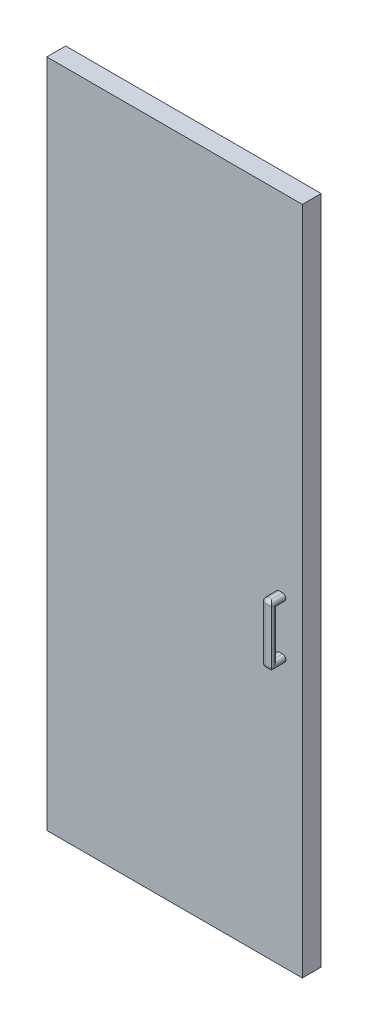
ISO-10303-21;
HEADER;
FILE_DESCRIPTION(('STEP AP214'),'2;1');
FILE_NAME('part.step','',(''),(''),'','','');
FILE_SCHEMA(('AUTOMOTIVE_DESIGN { 1 0 10303 214 1 1 1 1 }'));
ENDSEC;
DATA;
#1=APPLICATION_CONTEXT('core data for automotive mechanical design processes');
#2=APPLICATION_PROTOCOL_DEFINITION('international standard','automotive_design',2000,#1);
#3=PRODUCT_CONTEXT('',#1,'mechanical');
#4=PRODUCT('Part','Part','',(#3));
#5=PRODUCT_RELATED_PRODUCT_CATEGORY('part','',(#4));
#6=PRODUCT_DEFINITION_FORMATION('','',#4);
#7=PRODUCT_DEFINITION_CONTEXT('part definition',#1,'design');
#8=PRODUCT_DEFINITION('design','',#6,#7);
#9=PRODUCT_DEFINITION_SHAPE('','',#8);
#10=(LENGTH_UNIT() NAMED_UNIT(*) SI_UNIT(.MILLI.,.METRE.));
#11=(NAMED_UNIT(*) PLANE_ANGLE_UNIT() SI_UNIT($,.RADIAN.));
#12=(NAMED_UNIT(*) SI_UNIT($,.STERADIAN.) SOLID_ANGLE_UNIT());
#13=UNCERTAINTY_MEASURE_WITH_UNIT(LENGTH_MEASURE(1.E-05),#10,'distance_accuracy_value','');
#14=(GEOMETRIC_REPRESENTATION_CONTEXT(3) GLOBAL_UNCERTAINTY_ASSIGNED_CONTEXT((#13)) GLOBAL_UNIT_ASSIGNED_CONTEXT((#10,
#11,#12)) REPRESENTATION_CONTEXT('',''));
#15=CARTESIAN_POINT('',(0.,0.,0.));
#16=DIRECTION('',(0.,0.,1.));
#17=DIRECTION('',(1.,0.,0.));
#18=AXIS2_PLACEMENT_3D('',#15,#16,#17);
#19=CARTESIAN_POINT('',(0.,0.,0.));
#20=DIRECTION('',(0.,0.,1.));
#21=DIRECTION('',(1.,0.,0.));
#22=AXIS2_PLACEMENT_3D('',#19,#20,#21);
#23=PLANE('',#22);
#24=DIRECTION('',(-1.,0.,0.));
#25=VECTOR('',#24,1.);
#26=CARTESIAN_POINT('',(0.,446.201837212028,0.));
#27=LINE('',#26,#25);
#28=CARTESIAN_POINT('',(0.,446.201837212028,0.));
#29=VERTEX_POINT('',#28);
#30=CARTESIAN_POINT('',(-775.,446.201837212028,0.));
#31=VERTEX_POINT('',#30);
#32=EDGE_CURVE('E255',#29,#31,#27,.T.);
#33=ORIENTED_EDGE('',*,*,#32,.F.);
#34=DIRECTION('',(0.,1.,0.));
#35=VECTOR('',#34,1.);
#36=CARTESIAN_POINT('',(0.,0.,0.));
#37=LINE('',#36,#35);
#38=CARTESIAN_POINT('',(0.,-1585.79816278797,0.));
#39=VERTEX_POINT('',#38);
#40=EDGE_CURVE('E273',#39,#29,#37,.T.);
#41=ORIENTED_EDGE('',*,*,#40,.F.);
#42=DIRECTION('',(1.,0.,0.));
#43=VECTOR('',#42,1.);
#44=CARTESIAN_POINT('',(-775.,-1585.79816278797,0.));
#45=LINE('',#44,#43);
#46=CARTESIAN_POINT('',(-775.,-1585.79816278797,0.));
#47=VERTEX_POINT('',#46);
#48=EDGE_CURVE('E284',#47,#39,#45,.T.);
#49=ORIENTED_EDGE('',*,*,#48,.F.);
#50=DIRECTION('',(0.,-1.,0.));
#51=VECTOR('',#50,1.);
#52=CARTESIAN_POINT('',(-775.,446.201837212028,0.));
#53=LINE('',#52,#51);
#54=EDGE_CURVE('E282',#31,#47,#53,.T.);
#55=ORIENTED_EDGE('',*,*,#54,.F.);
#56=EDGE_LOOP('',(#33,#41,#49,#55));
#57=FACE_BOUND('',#56,.T.);
#58=DIRECTION('',(0.,1.,0.));
#59=VECTOR('',#58,1.);
#60=CARTESIAN_POINT('',(-145.,-924.798162787972,0.));
#61=LINE('',#60,#59);
#62=CARTESIAN_POINT('',(-145.,-924.798162787972,0.));
#63=VERTEX_POINT('',#62);
#64=CARTESIAN_POINT('',(-145.,-464.798162787972,0.));
#65=VERTEX_POINT('',#64);
#66=EDGE_CURVE('E231',#63,#65,#61,.T.);
#67=ORIENTED_EDGE('',*,*,#66,.F.);
#68=DIRECTION('',(-1.,0.,0.));
#69=VECTOR('',#68,1.);
#70=CARTESIAN_POINT('',(-25.,-924.798162787972,0.));
#71=LINE('',#70,#69);
#72=CARTESIAN_POINT('',(-25.,-924.798162787972,0.));
#73=VERTEX_POINT('',#72);
#74=EDGE_CURVE('E228',#73,#63,#71,.T.);
#75=ORIENTED_EDGE('',*,*,#74,.F.);
#76=DIRECTION('',(0.,-1.,0.));
#77=VECTOR('',#76,1.);
#78=CARTESIAN_POINT('',(-25.,-924.798162787972,0.));
#79=LINE('',#78,#77);
#80=CARTESIAN_POINT('',(-25.,-464.798162787972,0.));
#81=VERTEX_POINT('',#80);
#82=EDGE_CURVE('E59',#81,#73,#79,.T.);
#83=ORIENTED_EDGE('',*,*,#82,.F.);
#84=DIRECTION('',(1.,0.,0.));
#85=VECTOR('',#84,1.);
#86=CARTESIAN_POINT('',(-25.,-464.798162787972,0.));
#87=LINE('',#86,#85);
#88=EDGE_CURVE('E54',#65,#81,#87,.T.);
#89=ORIENTED_EDGE('',*,*,#88,.F.);
#90=EDGE_LOOP('',(#67,#75,#83,#89));
#91=FACE_BOUND('',#90,.T.);
#92=ADVANCED_FACE('F37',(#57,#91),#23,.F.);
#93=CARTESIAN_POINT('',(-79.9999999999999,-603.798162787972,101.15));
#94=DIRECTION('',(1.,0.,0.));
#95=DIRECTION('',(0.,1.,0.));
#96=AXIS2_PLACEMENT_3D('',#93,#94,#95);
#97=PLANE('',#96);
#98=DIRECTION('',(0.,-1.,0.));
#99=VECTOR('',#98,1.);
#100=CARTESIAN_POINT('',(-79.9999999999999,-603.798162787972,57.15));
#101=LINE('',#100,#99);
#102=CARTESIAN_POINT('',(-79.9999999999999,-774.798162787972,57.15));
#103=VERTEX_POINT('',#102);
#104=CARTESIAN_POINT('',(-79.9999999999999,-775.798162787972,57.15));
#105=VERTEX_POINT('',#104);
#106=EDGE_CURVE('E263',#103,#105,#101,.T.);
#107=ORIENTED_EDGE('',*,*,#106,.T.);
#108=DIRECTION('',(0.,0.,-1.));
#109=VECTOR('',#108,1.);
#110=CARTESIAN_POINT('',(-79.9999999999999,-775.798162787972,101.15));
#111=LINE('',#110,#109);
#112=CARTESIAN_POINT('',(-79.9999999999999,-775.798162787972,91.15));
#113=VERTEX_POINT('',#112);
#114=EDGE_CURVE('E326',#105,#113,#111,.F.);
#115=ORIENTED_EDGE('',*,*,#114,.T.);
#116=DIRECTION('',(0.,-1.,0.));
#117=VECTOR('',#116,1.);
#118=CARTESIAN_POINT('',(-79.9999999999999,-603.798162787972,91.15));
#119=LINE('',#118,#117);
#120=CARTESIAN_POINT('',(-79.9999999999999,-774.798162787972,91.15));
#121=VERTEX_POINT('',#120);
#122=EDGE_CURVE('E322',#113,#121,#119,.F.);
#123=ORIENTED_EDGE('',*,*,#122,.T.);
#124=DIRECTION('',(0.,0.,-1.));
#125=VECTOR('',#124,1.);
#126=CARTESIAN_POINT('',(-79.9999999999999,-774.798162787972,57.15));
#127=LINE('',#126,#125);
#128=EDGE_CURVE('E324',#121,#103,#127,.T.);
#129=ORIENTED_EDGE('',*,*,#128,.T.);
#130=EDGE_LOOP('',(#107,#115,#123,#129));
#131=FACE_BOUND('',#130,.T.);
#132=ADVANCED_FACE('F495',(#131),#97,.F.);
#133=CARTESIAN_POINT('',(-49.9999999999999,-603.798162787972,101.15));
#134=DIRECTION('',(-1.,0.,0.));
#135=DIRECTION('',(0.,-1.,0.));
#136=AXIS2_PLACEMENT_3D('',#133,#134,#135);
#137=PLANE('',#136);
#138=DIRECTION('',(0.,1.,0.));
#139=VECTOR('',#138,1.);
#140=CARTESIAN_POINT('',(-49.9999999999999,-603.798162787972,57.15));
#141=LINE('',#140,#139);
#142=CARTESIAN_POINT('',(-49.9999999999999,-614.798162787972,57.15));
#143=VERTEX_POINT('',#142);
#144=CARTESIAN_POINT('',(-49.9999999999999,-613.798162787972,57.15));
#145=VERTEX_POINT('',#144);
#146=EDGE_CURVE('E241',#143,#145,#141,.T.);
#147=ORIENTED_EDGE('',*,*,#146,.T.);
#148=DIRECTION('',(0.,0.,-1.));
#149=VECTOR('',#148,1.);
#150=CARTESIAN_POINT('',(-49.9999999999999,-613.798162787972,101.15));
#151=LINE('',#150,#149);
#152=CARTESIAN_POINT('',(-49.9999999999999,-613.798162787972,101.15));
#153=VERTEX_POINT('',#152);
#154=EDGE_CURVE('E341',#145,#153,#151,.F.);
#155=ORIENTED_EDGE('',*,*,#154,.T.);
#156=DIRECTION('',(0.,1.,0.));
#157=VECTOR('',#156,1.);
#158=CARTESIAN_POINT('',(-49.9999999999999,-603.798162787972,101.15));
#159=LINE('',#158,#157);
#160=CARTESIAN_POINT('',(-49.9999999999999,-775.798162787972,101.15));
#161=VERTEX_POINT('',#160);
#162=EDGE_CURVE('E252',#161,#153,#159,.T.);
#163=ORIENTED_EDGE('',*,*,#162,.F.);
#164=DIRECTION('',(0.,0.,-1.));
#165=VECTOR('',#164,1.);
#166=CARTESIAN_POINT('',(-49.9999999999999,-775.798162787972,101.15));
#167=LINE('',#166,#165);
#168=CARTESIAN_POINT('',(-49.9999999999999,-775.798162787972,57.15));
#169=VERTEX_POINT('',#168);
#170=EDGE_CURVE('E333',#161,#169,#167,.T.);
#171=ORIENTED_EDGE('',*,*,#170,.T.);
#172=CARTESIAN_POINT('',(-49.9999999999999,-774.798162787972,57.15));
#173=VERTEX_POINT('',#172);
#174=EDGE_CURVE('E257',#169,#173,#141,.T.);
#175=ORIENTED_EDGE('',*,*,#174,.T.);
#176=DIRECTION('',(0.,0.,-1.));
#177=VECTOR('',#176,1.);
#178=CARTESIAN_POINT('',(-49.9999999999999,-774.798162787972,83.15));
#179=LINE('',#178,#177);
#180=CARTESIAN_POINT('',(-49.9999999999999,-774.798162787972,93.15));
#181=VERTEX_POINT('',#180);
#182=EDGE_CURVE('E335',#173,#181,#179,.F.);
#183=ORIENTED_EDGE('',*,*,#182,.T.);
#184=DIRECTION('',(0.,-1.,0.));
#185=VECTOR('',#184,1.);
#186=CARTESIAN_POINT('',(-49.9999999999999,-624.798162787972,93.15));
#187=LINE('',#186,#185);
#188=CARTESIAN_POINT('',(-49.9999999999999,-614.798162787972,93.15));
#189=VERTEX_POINT('',#188);
#190=EDGE_CURVE('E337',#181,#189,#187,.F.);
#191=ORIENTED_EDGE('',*,*,#190,.T.);
#192=DIRECTION('',(0.,0.,1.));
#193=VECTOR('',#192,1.);
#194=CARTESIAN_POINT('',(-49.9999999999999,-614.798162787972,57.15));
#195=LINE('',#194,#193);
#196=EDGE_CURVE('E339',#189,#143,#195,.F.);
#197=ORIENTED_EDGE('',*,*,#196,.T.);
#198=EDGE_LOOP('',(#147,#155,#163,#171,#175,#183,#191,#197));
#199=FACE_BOUND('',#198,.T.);
#200=ADVANCED_FACE('F415',(#199),#137,.F.);
#201=DIRECTION('',(0.,-1.,0.));
#202=VECTOR('',#201,1.);
#203=CARTESIAN_POINT('',(-79.9999999999999,-603.798162787972,91.15));
#204=LINE('',#203,#202);
#205=CARTESIAN_POINT('',(-79.9999999999999,-614.798162787972,91.15));
#206=VERTEX_POINT('',#205);
#207=CARTESIAN_POINT('',(-79.9999999999999,-613.798162787972,91.15));
#208=VERTEX_POINT('',#207);
#209=EDGE_CURVE('E316',#206,#208,#204,.F.);
#210=ORIENTED_EDGE('',*,*,#209,.T.);
#211=DIRECTION('',(0.,0.,-1.));
#212=VECTOR('',#211,1.);
#213=CARTESIAN_POINT('',(-79.9999999999999,-613.798162787972,101.15));
#214=LINE('',#213,#212);
#215=CARTESIAN_POINT('',(-79.9999999999999,-613.798162787972,57.15));
#216=VERTEX_POINT('',#215);
#217=EDGE_CURVE('E320',#208,#216,#214,.T.);
#218=ORIENTED_EDGE('',*,*,#217,.T.);
#219=CARTESIAN_POINT('',(-79.9999999999999,-614.798162787972,57.15));
#220=VERTEX_POINT('',#219);
#221=EDGE_CURVE('E264',#216,#220,#101,.T.);
#222=ORIENTED_EDGE('',*,*,#221,.T.);
#223=DIRECTION('',(0.,0.,1.));
#224=VECTOR('',#223,1.);
#225=CARTESIAN_POINT('',(-79.9999999999999,-614.798162787972,83.15));
#226=LINE('',#225,#224);
#227=EDGE_CURVE('E318',#220,#206,#226,.T.);
#228=ORIENTED_EDGE('',*,*,#227,.T.);
#229=EDGE_LOOP('',(#210,#218,#222,#228));
#230=FACE_BOUND('',#229,.T.);
#231=ADVANCED_FACE('F501',(#230),#97,.F.);
#232=CARTESIAN_POINT('',(0.,0.,57.15));
#233=DIRECTION('',(0.,0.,1.));
#234=DIRECTION('',(1.,0.,0.));
#235=AXIS2_PLACEMENT_3D('',#232,#233,#234);
#236=PLANE('',#235);
#237=DIRECTION('',(-1.,0.,0.));
#238=VECTOR('',#237,1.);
#239=CARTESIAN_POINT('',(-35.9999999999999,-764.798162787972,57.15));
#240=LINE('',#239,#238);
#241=CARTESIAN_POINT('',(-59.9999999999999,-764.798162787972,57.15));
#242=VERTEX_POINT('',#241);
#243=CARTESIAN_POINT('',(-69.9999999999999,-764.798162787972,57.15));
#244=VERTEX_POINT('',#243);
#245=EDGE_CURVE('E238',#242,#244,#240,.T.);
#246=ORIENTED_EDGE('',*,*,#245,.F.);
#247=CARTESIAN_POINT('',(-59.9999999999999,-774.798162787972,57.15));
#248=DIRECTION('',(0.,0.,1.));
#249=DIRECTION('',(1.,0.,0.));
#250=AXIS2_PLACEMENT_3D('',#247,#248,#249);
#251=CIRCLE('',#250,10.);
#252=EDGE_CURVE('E361',#242,#173,#251,.F.);
#253=ORIENTED_EDGE('',*,*,#252,.T.);
#254=ORIENTED_EDGE('',*,*,#174,.F.);
#255=CARTESIAN_POINT('',(-59.9999999999999,-775.798162787972,57.15));
#256=DIRECTION('',(0.,0.,1.));
#257=DIRECTION('',(1.,0.,0.));
#258=AXIS2_PLACEMENT_3D('',#255,#256,#257);
#259=CIRCLE('',#258,10.);
#260=CARTESIAN_POINT('',(-59.9999999999999,-785.798162787972,57.15));
#261=VERTEX_POINT('',#260);
#262=EDGE_CURVE('E363',#169,#261,#259,.F.);
#263=ORIENTED_EDGE('',*,*,#262,.T.);
#264=DIRECTION('',(1.,0.,0.));
#265=VECTOR('',#264,1.);
#266=CARTESIAN_POINT('',(-79.9999999999999,-785.798162787972,57.15));
#267=LINE('',#266,#265);
#268=CARTESIAN_POINT('',(-69.9999999999999,-785.798162787972,57.15));
#269=VERTEX_POINT('',#268);
#270=EDGE_CURVE('E256',#269,#261,#267,.T.);
#271=ORIENTED_EDGE('',*,*,#270,.F.);
#272=CARTESIAN_POINT('',(-69.9999999999999,-775.798162787972,57.15));
#273=DIRECTION('',(0.,0.,1.));
#274=DIRECTION('',(1.,0.,0.));
#275=AXIS2_PLACEMENT_3D('',#272,#273,#274);
#276=CIRCLE('',#275,10.);
#277=EDGE_CURVE('E46',#269,#105,#276,.F.);
#278=ORIENTED_EDGE('',*,*,#277,.T.);
#279=ORIENTED_EDGE('',*,*,#106,.F.);
#280=CARTESIAN_POINT('',(-69.9999999999999,-774.798162787972,57.15));
#281=DIRECTION('',(0.,0.,1.));
#282=DIRECTION('',(1.,0.,0.));
#283=AXIS2_PLACEMENT_3D('',#280,#281,#282);
#284=CIRCLE('',#283,10.);
#285=EDGE_CURVE('E11',#103,#244,#284,.F.);
#286=ORIENTED_EDGE('',*,*,#285,.T.);
#287=EDGE_LOOP('',(#246,#253,#254,#263,#271,#278,#279,#286));
#288=FACE_BOUND('',#287,.T.);
#289=ORIENTED_EDGE('',*,*,#146,.F.);
#290=CARTESIAN_POINT('',(-59.9999999999999,-614.798162787972,57.15));
#291=DIRECTION('',(0.,0.,1.));
#292=DIRECTION('',(1.,0.,0.));
#293=AXIS2_PLACEMENT_3D('',#290,#291,#292);
#294=CIRCLE('',#293,10.);
#295=CARTESIAN_POINT('',(-59.9999999999999,-624.798162787972,57.15));
#296=VERTEX_POINT('',#295);
#297=EDGE_CURVE('E359',#143,#296,#294,.F.);
#298=ORIENTED_EDGE('',*,*,#297,.T.);
#299=DIRECTION('',(-1.,0.,0.));
#300=VECTOR('',#299,1.);
#301=CARTESIAN_POINT('',(-35.9999999999999,-624.798162787972,57.15));
#302=LINE('',#301,#300);
#303=CARTESIAN_POINT('',(-69.9999999999999,-624.798162787972,57.15));
#304=VERTEX_POINT('',#303);
#305=EDGE_CURVE('E242',#296,#304,#302,.T.);
#306=ORIENTED_EDGE('',*,*,#305,.T.);
#307=CARTESIAN_POINT('',(-69.9999999999999,-614.798162787972,57.15));
#308=DIRECTION('',(0.,0.,1.));
#309=DIRECTION('',(1.,0.,0.));
#310=AXIS2_PLACEMENT_3D('',#307,#308,#309);
#311=CIRCLE('',#310,10.);
#312=EDGE_CURVE('E355',#304,#220,#311,.F.);
#313=ORIENTED_EDGE('',*,*,#312,.T.);
#314=ORIENTED_EDGE('',*,*,#221,.F.);
#315=CARTESIAN_POINT('',(-69.9999999999999,-613.798162787972,57.15));
#316=DIRECTION('',(0.,0.,1.));
#317=DIRECTION('',(1.,0.,0.));
#318=AXIS2_PLACEMENT_3D('',#315,#316,#317);
#319=CIRCLE('',#318,10.);
#320=CARTESIAN_POINT('',(-69.9999999999999,-603.798162787972,57.15));
#321=VERTEX_POINT('',#320);
#322=EDGE_CURVE('E353',#216,#321,#319,.F.);
#323=ORIENTED_EDGE('',*,*,#322,.T.);
#324=DIRECTION('',(-1.,0.,0.));
#325=VECTOR('',#324,1.);
#326=CARTESIAN_POINT('',(-79.9999999999999,-603.798162787972,57.15));
#327=LINE('',#326,#325);
#328=CARTESIAN_POINT('',(-59.9999999999999,-603.798162787972,57.15));
#329=VERTEX_POINT('',#328);
#330=EDGE_CURVE('E260',#329,#321,#327,.T.);
#331=ORIENTED_EDGE('',*,*,#330,.F.);
#332=CARTESIAN_POINT('',(-59.9999999999999,-613.798162787972,57.15));
#333=DIRECTION('',(0.,0.,1.));
#334=DIRECTION('',(1.,0.,0.));
#335=AXIS2_PLACEMENT_3D('',#332,#333,#334);
#336=CIRCLE('',#335,10.);
#337=EDGE_CURVE('E357',#329,#145,#336,.F.);
#338=ORIENTED_EDGE('',*,*,#337,.T.);
#339=EDGE_LOOP('',(#289,#298,#306,#313,#314,#323,#331,#338));
#340=FACE_BOUND('',#339,.T.);
#341=DIRECTION('',(-1.,0.,0.));
#342=VECTOR('',#341,1.);
#343=CARTESIAN_POINT('',(0.,446.201837212028,57.15));
#344=LINE('',#343,#342);
#345=CARTESIAN_POINT('',(0.,446.201837212028,57.15));
#346=VERTEX_POINT('',#345);
#347=CARTESIAN_POINT('',(-775.,446.201837212028,57.15));
#348=VERTEX_POINT('',#347);
#349=EDGE_CURVE('E269',#346,#348,#344,.T.);
#350=ORIENTED_EDGE('',*,*,#349,.T.);
#351=DIRECTION('',(0.,-1.,0.));
#352=VECTOR('',#351,1.);
#353=CARTESIAN_POINT('',(-775.,446.201837212028,57.15));
#354=LINE('',#353,#352);
#355=CARTESIAN_POINT('',(-775.,-1585.79816278797,57.15));
#356=VERTEX_POINT('',#355);
#357=EDGE_CURVE('E272',#348,#356,#354,.T.);
#358=ORIENTED_EDGE('',*,*,#357,.T.);
#359=DIRECTION('',(1.,0.,0.));
#360=VECTOR('',#359,1.);
#361=CARTESIAN_POINT('',(-775.,-1585.79816278797,57.15));
#362=LINE('',#361,#360);
#363=CARTESIAN_POINT('',(0.,-1585.79816278797,57.15));
#364=VERTEX_POINT('',#363);
#365=EDGE_CURVE('E275',#356,#364,#362,.T.);
#366=ORIENTED_EDGE('',*,*,#365,.T.);
#367=DIRECTION('',(0.,1.,0.));
#368=VECTOR('',#367,1.);
#369=CARTESIAN_POINT('',(0.,-1585.79816278797,57.15));
#370=LINE('',#369,#368);
#371=EDGE_CURVE('E277',#364,#346,#370,.T.);
#372=ORIENTED_EDGE('',*,*,#371,.T.);
#373=EDGE_LOOP('',(#350,#358,#366,#372));
#374=FACE_BOUND('',#373,.T.);
#375=ADVANCED_FACE('F419',(#288,#340,#374),#236,.T.);
#376=CARTESIAN_POINT('',(0.,446.201837212028,57.15));
#377=DIRECTION('',(0.,-1.,0.));
#378=DIRECTION('',(1.,0.,0.));
#379=AXIS2_PLACEMENT_3D('',#376,#377,#378);
#380=PLANE('',#379);
#381=ORIENTED_EDGE('',*,*,#32,.T.);
#382=DIRECTION('',(0.,0.,-1.));
#383=VECTOR('',#382,1.);
#384=CARTESIAN_POINT('',(-775.,446.201837212028,57.15));
#385=LINE('',#384,#383);
#386=EDGE_CURVE('E296',#348,#31,#385,.T.);
#387=ORIENTED_EDGE('',*,*,#386,.F.);
#388=ORIENTED_EDGE('',*,*,#349,.F.);
#389=DIRECTION('',(0.,0.,-1.));
#390=VECTOR('',#389,1.);
#391=CARTESIAN_POINT('',(0.,446.201837212028,57.15));
#392=LINE('',#391,#390);
#393=EDGE_CURVE('E279',#346,#29,#392,.T.);
#394=ORIENTED_EDGE('',*,*,#393,.T.);
#395=EDGE_LOOP('',(#381,#387,#388,#394));
#396=FACE_BOUND('',#395,.T.);
#397=ADVANCED_FACE('F542',(#396),#380,.F.);
#398=CARTESIAN_POINT('',(-775.,446.201837212028,57.15));
#399=DIRECTION('',(1.,0.,0.));
#400=DIRECTION('',(0.,1.,0.));
#401=AXIS2_PLACEMENT_3D('',#398,#399,#400);
#402=PLANE('',#401);
#403=ORIENTED_EDGE('',*,*,#54,.T.);
#404=DIRECTION('',(0.,0.,-1.));
#405=VECTOR('',#404,1.);
#406=CARTESIAN_POINT('',(-775.,-1585.79816278797,57.15));
#407=LINE('',#406,#405);
#408=EDGE_CURVE('E293',#356,#47,#407,.T.);
#409=ORIENTED_EDGE('',*,*,#408,.F.);
#410=ORIENTED_EDGE('',*,*,#357,.F.);
#411=ORIENTED_EDGE('',*,*,#386,.T.);
#412=EDGE_LOOP('',(#403,#409,#410,#411));
#413=FACE_BOUND('',#412,.T.);
#414=ADVANCED_FACE('F538',(#413),#402,.F.);
#415=CARTESIAN_POINT('',(-775.,-1585.79816278797,57.15));
#416=DIRECTION('',(0.,1.,0.));
#417=DIRECTION('',(0.,0.,1.));
#418=AXIS2_PLACEMENT_3D('',#415,#416,#417);
#419=PLANE('',#418);
#420=ORIENTED_EDGE('',*,*,#48,.T.);
#421=DIRECTION('',(0.,0.,-1.));
#422=VECTOR('',#421,1.);
#423=CARTESIAN_POINT('',(0.,-1585.79816278797,57.15));
#424=LINE('',#423,#422);
#425=EDGE_CURVE('E290',#364,#39,#424,.T.);
#426=ORIENTED_EDGE('',*,*,#425,.F.);
#427=ORIENTED_EDGE('',*,*,#365,.F.);
#428=ORIENTED_EDGE('',*,*,#408,.T.);
#429=EDGE_LOOP('',(#420,#426,#427,#428));
#430=FACE_BOUND('',#429,.T.);
#431=ADVANCED_FACE('F534',(#430),#419,.F.);
#432=CARTESIAN_POINT('',(0.,0.,57.15));
#433=DIRECTION('',(-1.,0.,0.));
#434=DIRECTION('',(0.,0.,1.));
#435=AXIS2_PLACEMENT_3D('',#432,#433,#434);
#436=PLANE('',#435);
#437=ORIENTED_EDGE('',*,*,#40,.T.);
#438=ORIENTED_EDGE('',*,*,#393,.F.);
#439=ORIENTED_EDGE('',*,*,#371,.F.);
#440=ORIENTED_EDGE('',*,*,#425,.T.);
#441=EDGE_LOOP('',(#437,#438,#439,#440));
#442=FACE_BOUND('',#441,.T.);
#443=ADVANCED_FACE('F531',(#442),#436,.F.);
#444=CARTESIAN_POINT('',(-79.9999999999999,-603.798162787972,101.15));
#445=DIRECTION('',(0.,-1.,0.));
#446=DIRECTION('',(0.,0.,-1.));
#447=AXIS2_PLACEMENT_3D('',#444,#445,#446);
#448=PLANE('',#447);
#449=ORIENTED_EDGE('',*,*,#330,.T.);
#450=DIRECTION('',(0.,0.,-1.));
#451=VECTOR('',#450,1.);
#452=CARTESIAN_POINT('',(-69.9999999999999,-603.798162787972,101.15));
#453=LINE('',#452,#451);
#454=CARTESIAN_POINT('',(-69.9999999999999,-603.798162787972,91.15));
#455=VERTEX_POINT('',#454);
#456=EDGE_CURVE('E310',#321,#455,#453,.F.);
#457=ORIENTED_EDGE('',*,*,#456,.T.);
#458=DIRECTION('',(-1.,0.,0.));
#459=VECTOR('',#458,1.);
#460=CARTESIAN_POINT('',(-49.9999999999999,-603.798162787972,91.15));
#461=LINE('',#460,#459);
#462=CARTESIAN_POINT('',(-59.9999999999999,-603.798162787972,91.15));
#463=VERTEX_POINT('',#462);
#464=EDGE_CURVE('E308',#455,#463,#461,.F.);
#465=ORIENTED_EDGE('',*,*,#464,.T.);
#466=DIRECTION('',(0.,0.,-1.));
#467=VECTOR('',#466,1.);
#468=CARTESIAN_POINT('',(-59.9999999999999,-603.798162787972,101.15));
#469=LINE('',#468,#467);
#470=EDGE_CURVE('E306',#463,#329,#469,.T.);
#471=ORIENTED_EDGE('',*,*,#470,.T.);
#472=EDGE_LOOP('',(#449,#457,#465,#471));
#473=FACE_BOUND('',#472,.T.);
#474=ADVANCED_FACE('F509',(#473),#448,.F.);
#475=CARTESIAN_POINT('',(-79.9999999999999,-785.798162787972,101.15));
#476=DIRECTION('',(0.,1.,0.));
#477=DIRECTION('',(0.,0.,1.));
#478=AXIS2_PLACEMENT_3D('',#475,#476,#477);
#479=PLANE('',#478);
#480=ORIENTED_EDGE('',*,*,#270,.T.);
#481=DIRECTION('',(0.,0.,-1.));
#482=VECTOR('',#481,1.);
#483=CARTESIAN_POINT('',(-59.9999999999999,-785.798162787972,101.15));
#484=LINE('',#483,#482);
#485=CARTESIAN_POINT('',(-59.9999999999999,-785.798162787972,91.15));
#486=VERTEX_POINT('',#485);
#487=EDGE_CURVE('E351',#261,#486,#484,.F.);
#488=ORIENTED_EDGE('',*,*,#487,.T.);
#489=DIRECTION('',(1.,0.,0.));
#490=VECTOR('',#489,1.);
#491=CARTESIAN_POINT('',(-79.9999999999999,-785.798162787972,91.15));
#492=LINE('',#491,#490);
#493=CARTESIAN_POINT('',(-69.9999999999999,-785.798162787972,91.15));
#494=VERTEX_POINT('',#493);
#495=EDGE_CURVE('E347',#486,#494,#492,.F.);
#496=ORIENTED_EDGE('',*,*,#495,.T.);
#497=DIRECTION('',(0.,0.,-1.));
#498=VECTOR('',#497,1.);
#499=CARTESIAN_POINT('',(-69.9999999999999,-785.798162787972,101.15));
#500=LINE('',#499,#498);
#501=EDGE_CURVE('E349',#494,#269,#500,.T.);
#502=ORIENTED_EDGE('',*,*,#501,.T.);
#503=EDGE_LOOP('',(#480,#488,#496,#502));
#504=FACE_BOUND('',#503,.T.);
#505=ADVANCED_FACE('F490',(#504),#479,.F.);
#506=CARTESIAN_POINT('',(0.,0.,101.15));
#507=DIRECTION('',(0.,0.,1.));
#508=DIRECTION('',(1.,0.,0.));
#509=AXIS2_PLACEMENT_3D('',#506,#507,#508);
#510=PLANE('',#509);
#511=ORIENTED_EDGE('',*,*,#162,.T.);
#512=DIRECTION('',(-1.,0.,0.));
#513=VECTOR('',#512,1.);
#514=CARTESIAN_POINT('',(-79.9999999999999,-613.798162787972,101.15));
#515=LINE('',#514,#513);
#516=CARTESIAN_POINT('',(-69.9999999999999,-613.798162787972,101.15));
#517=VERTEX_POINT('',#516);
#518=EDGE_CURVE('E303',#153,#517,#515,.T.);
#519=ORIENTED_EDGE('',*,*,#518,.T.);
#520=DIRECTION('',(0.,-1.,0.));
#521=VECTOR('',#520,1.);
#522=CARTESIAN_POINT('',(-69.9999999999999,-785.798162787972,101.15));
#523=LINE('',#522,#521);
#524=CARTESIAN_POINT('',(-69.9999999999999,-775.798162787972,101.15));
#525=VERTEX_POINT('',#524);
#526=EDGE_CURVE('E301',#517,#525,#523,.T.);
#527=ORIENTED_EDGE('',*,*,#526,.T.);
#528=DIRECTION('',(1.,0.,0.));
#529=VECTOR('',#528,1.);
#530=CARTESIAN_POINT('',(-49.9999999999999,-775.798162787972,101.15));
#531=LINE('',#530,#529);
#532=EDGE_CURVE('E299',#525,#161,#531,.T.);
#533=ORIENTED_EDGE('',*,*,#532,.T.);
#534=EDGE_LOOP('',(#511,#519,#527,#533));
#535=FACE_BOUND('',#534,.T.);
#536=ADVANCED_FACE('F473',(#535),#510,.T.);
#537=CARTESIAN_POINT('',(-35.9999999999999,-764.798162787972,0.));
#538=DIRECTION('',(0.,1.,0.));
#539=DIRECTION('',(-1.,0.,0.));
#540=AXIS2_PLACEMENT_3D('',#537,#538,#539);
#541=PLANE('',#540);
#542=DIRECTION('',(-1.,0.,0.));
#543=VECTOR('',#542,1.);
#544=CARTESIAN_POINT('',(-35.9999999999999,-764.798162787972,83.15));
#545=LINE('',#544,#543);
#546=CARTESIAN_POINT('',(-59.9999999999999,-764.798162787972,83.15));
#547=VERTEX_POINT('',#546);
#548=CARTESIAN_POINT('',(-69.9999999999999,-764.798162787972,83.15));
#549=VERTEX_POINT('',#548);
#550=EDGE_CURVE('E248',#547,#549,#545,.T.);
#551=ORIENTED_EDGE('',*,*,#550,.F.);
#552=DIRECTION('',(0.,0.,-1.));
#553=VECTOR('',#552,1.);
#554=CARTESIAN_POINT('',(-59.9999999999999,-764.798162787972,57.15));
#555=LINE('',#554,#553);
#556=EDGE_CURVE('E345',#547,#242,#555,.T.);
#557=ORIENTED_EDGE('',*,*,#556,.T.);
#558=ORIENTED_EDGE('',*,*,#245,.T.);
#559=DIRECTION('',(0.,0.,-1.));
#560=VECTOR('',#559,1.);
#561=CARTESIAN_POINT('',(-69.9999999999999,-764.798162787972,83.15));
#562=LINE('',#561,#560);
#563=EDGE_CURVE('E343',#244,#549,#562,.F.);
#564=ORIENTED_EDGE('',*,*,#563,.T.);
#565=EDGE_LOOP('',(#551,#557,#558,#564));
#566=FACE_BOUND('',#565,.T.);
#567=ADVANCED_FACE('F573',(#566),#541,.T.);
#568=CARTESIAN_POINT('',(-35.9999999999999,-624.798162787972,0.));
#569=DIRECTION('',(0.,-1.,0.));
#570=DIRECTION('',(1.,0.,0.));
#571=AXIS2_PLACEMENT_3D('',#568,#569,#570);
#572=PLANE('',#571);
#573=DIRECTION('',(-1.,0.,0.));
#574=VECTOR('',#573,1.);
#575=CARTESIAN_POINT('',(-35.9999999999999,-624.798162787972,83.15));
#576=LINE('',#575,#574);
#577=CARTESIAN_POINT('',(-59.9999999999999,-624.798162787972,83.15));
#578=VERTEX_POINT('',#577);
#579=CARTESIAN_POINT('',(-69.9999999999999,-624.798162787972,83.15));
#580=VERTEX_POINT('',#579);
#581=EDGE_CURVE('E245',#578,#580,#576,.T.);
#582=ORIENTED_EDGE('',*,*,#581,.T.);
#583=DIRECTION('',(0.,0.,1.));
#584=VECTOR('',#583,1.);
#585=CARTESIAN_POINT('',(-69.9999999999999,-624.798162787972,57.15));
#586=LINE('',#585,#584);
#587=EDGE_CURVE('E331',#580,#304,#586,.F.);
#588=ORIENTED_EDGE('',*,*,#587,.T.);
#589=ORIENTED_EDGE('',*,*,#305,.F.);
#590=DIRECTION('',(0.,0.,1.));
#591=VECTOR('',#590,1.);
#592=CARTESIAN_POINT('',(-59.9999999999999,-624.798162787972,83.15));
#593=LINE('',#592,#591);
#594=EDGE_CURVE('E328',#296,#578,#593,.T.);
#595=ORIENTED_EDGE('',*,*,#594,.T.);
#596=EDGE_LOOP('',(#582,#588,#589,#595));
#597=FACE_BOUND('',#596,.T.);
#598=ADVANCED_FACE('F443',(#597),#572,.T.);
#599=CARTESIAN_POINT('',(-36.0000000000001,0.,83.1499999999999));
#600=DIRECTION('',(0.,0.,-1.));
#601=DIRECTION('',(0.,1.,0.));
#602=AXIS2_PLACEMENT_3D('',#599,#600,#601);
#603=PLANE('',#602);
#604=ORIENTED_EDGE('',*,*,#550,.T.);
#605=DIRECTION('',(0.,-1.,0.));
#606=VECTOR('',#605,1.);
#607=CARTESIAN_POINT('',(-69.9999999999999,-624.798162787972,83.15));
#608=LINE('',#607,#606);
#609=EDGE_CURVE('E314',#549,#580,#608,.F.);
#610=ORIENTED_EDGE('',*,*,#609,.T.);
#611=ORIENTED_EDGE('',*,*,#581,.F.);
#612=DIRECTION('',(0.,-1.,0.));
#613=VECTOR('',#612,1.);
#614=CARTESIAN_POINT('',(-59.9999999999999,-764.798162787972,83.15));
#615=LINE('',#614,#613);
#616=EDGE_CURVE('E312',#578,#547,#615,.T.);
#617=ORIENTED_EDGE('',*,*,#616,.T.);
#618=EDGE_LOOP('',(#604,#610,#611,#617));
#619=FACE_BOUND('',#618,.T.);
#620=ADVANCED_FACE('F445',(#619),#603,.T.);
#621=CARTESIAN_POINT('',(-59.9999999999999,-775.798162787972,101.15));
#622=DIRECTION('',(0.,0.,-1.));
#623=DIRECTION('',(-1.,0.,0.));
#624=AXIS2_PLACEMENT_3D('',#621,#622,#623);
#625=CYLINDRICAL_SURFACE('',#624,10.);
#626=ORIENTED_EDGE('',*,*,#262,.F.);
#627=ORIENTED_EDGE('',*,*,#170,.F.);
#628=CARTESIAN_POINT('',(-59.9999999999999,-775.798162787972,91.15));
#629=DIRECTION('',(-0.707106781186547,0.,0.707106781186547));
#630=DIRECTION('',(-0.707106781186547,0.,-0.707106781186547));
#631=AXIS2_PLACEMENT_3D('',#628,#629,#630);
#632=ELLIPSE('',#631,14.1421356237309,10.);
#633=EDGE_CURVE('E251',#486,#161,#632,.T.);
#634=ORIENTED_EDGE('',*,*,#633,.F.);
#635=ORIENTED_EDGE('',*,*,#487,.F.);
#636=EDGE_LOOP('',(#626,#627,#634,#635));
#637=FACE_BOUND('',#636,.T.);
#638=ADVANCED_FACE('F410',(#637),#625,.T.);
#639=CARTESIAN_POINT('',(0.,-775.798162787972,91.15));
#640=DIRECTION('',(-1.,0.,0.));
#641=DIRECTION('',(0.,0.,1.));
#642=AXIS2_PLACEMENT_3D('',#639,#640,#641);
#643=CYLINDRICAL_SURFACE('',#642,10.);
#644=ORIENTED_EDGE('',*,*,#633,.T.);
#645=ORIENTED_EDGE('',*,*,#532,.F.);
#646=CARTESIAN_POINT('',(-69.9999999999999,-775.798162787972,91.15));
#647=DIRECTION('',(-1.,0.,0.));
#648=DIRECTION('',(0.,0.,1.));
#649=AXIS2_PLACEMENT_3D('',#646,#647,#648);
#650=CIRCLE('',#649,10.);
#651=EDGE_CURVE('E396',#494,#525,#650,.T.);
#652=ORIENTED_EDGE('',*,*,#651,.F.);
#653=ORIENTED_EDGE('',*,*,#495,.F.);
#654=EDGE_LOOP('',(#644,#645,#652,#653));
#655=FACE_BOUND('',#654,.T.);
#656=ADVANCED_FACE('F404',(#655),#643,.T.);
#657=CARTESIAN_POINT('',(-69.9999999999999,-775.798162787972,101.15));
#658=DIRECTION('',(0.,0.,-1.));
#659=DIRECTION('',(-1.,0.,0.));
#660=AXIS2_PLACEMENT_3D('',#657,#658,#659);
#661=CYLINDRICAL_SURFACE('',#660,10.);
#662=ORIENTED_EDGE('',*,*,#277,.F.);
#663=ORIENTED_EDGE('',*,*,#501,.F.);
#664=CARTESIAN_POINT('',(-69.9999999999999,-775.798162787972,91.15));
#665=DIRECTION('',(0.,0.,1.));
#666=DIRECTION('',(1.,0.,0.));
#667=AXIS2_PLACEMENT_3D('',#664,#665,#666);
#668=CIRCLE('',#667,10.);
#669=EDGE_CURVE('E393',#113,#494,#668,.T.);
#670=ORIENTED_EDGE('',*,*,#669,.F.);
#671=ORIENTED_EDGE('',*,*,#114,.F.);
#672=EDGE_LOOP('',(#662,#663,#670,#671));
#673=FACE_BOUND('',#672,.T.);
#674=ADVANCED_FACE('F488',(#673),#661,.T.);
#675=CARTESIAN_POINT('',(-69.9999999999999,-775.798162787972,91.15));
#676=DIRECTION('',(0.,-1.,0.));
#677=DIRECTION('',(0.,0.,-1.));
#678=AXIS2_PLACEMENT_3D('',#675,#676,#677);
#679=SPHERICAL_SURFACE('',#678,10.);
#680=ORIENTED_EDGE('',*,*,#669,.T.);
#681=ORIENTED_EDGE('',*,*,#651,.T.);
#682=CARTESIAN_POINT('',(-69.9999999999999,-775.798162787972,91.15));
#683=DIRECTION('',(0.,-1.,0.));
#684=DIRECTION('',(0.,0.,-1.));
#685=AXIS2_PLACEMENT_3D('',#682,#683,#684);
#686=CIRCLE('',#685,10.);
#687=EDGE_CURVE('E386',#113,#525,#686,.F.);
#688=ORIENTED_EDGE('',*,*,#687,.F.);
#689=EDGE_LOOP('',(#680,#681,#688));
#690=FACE_BOUND('',#689,.T.);
#691=ADVANCED_FACE('F482',(#690),#679,.T.);
#692=CARTESIAN_POINT('',(-69.9999999999999,-774.798162787972,101.15));
#693=DIRECTION('',(0.,0.,1.));
#694=DIRECTION('',(1.,0.,0.));
#695=AXIS2_PLACEMENT_3D('',#692,#693,#694);
#696=CYLINDRICAL_SURFACE('',#695,10.);
#697=CARTESIAN_POINT('',(-69.9999999999999,-774.798162787972,93.15));
#698=DIRECTION('',(0.,0.707106781186548,0.707106781186547));
#699=DIRECTION('',(0.,0.707106781186547,-0.707106781186547));
#700=AXIS2_PLACEMENT_3D('',#697,#698,#699);
#701=ELLIPSE('',#700,14.142135623731,10.);
#702=CARTESIAN_POINT('',(-79.9498743710661,-773.798162787972,92.15));
#703=VERTEX_POINT('',#702);
#704=EDGE_CURVE('E391',#549,#703,#701,.T.);
#705=ORIENTED_EDGE('',*,*,#704,.F.);
#706=ORIENTED_EDGE('',*,*,#563,.F.);
#707=ORIENTED_EDGE('',*,*,#285,.F.);
#708=ORIENTED_EDGE('',*,*,#128,.F.);
#709=CARTESIAN_POINT('',(-69.9999999999999,-774.798162787972,91.15));
#710=DIRECTION('',(0.,-0.707106781186547,0.707106781186547));
#711=DIRECTION('',(0.,0.707106781186547,0.707106781186547));
#712=AXIS2_PLACEMENT_3D('',#709,#710,#711);
#713=ELLIPSE('',#712,14.1421356237309,10.);
#714=EDGE_CURVE('E383',#703,#121,#713,.T.);
#715=ORIENTED_EDGE('',*,*,#714,.F.);
#716=EDGE_LOOP('',(#705,#706,#707,#708,#715));
#717=FACE_BOUND('',#716,.T.);
#718=ADVANCED_FACE('F498',(#717),#696,.T.);
#719=CARTESIAN_POINT('',(-69.9999999999999,-603.798162787972,93.15));
#720=DIRECTION('',(0.,1.,0.));
#721=DIRECTION('',(-1.,0.,0.));
#722=AXIS2_PLACEMENT_3D('',#719,#720,#721);
#723=CYLINDRICAL_SURFACE('',#722,10.);
#724=CARTESIAN_POINT('',(-69.9999999999999,-614.798162787972,93.15));
#725=DIRECTION('',(0.,0.707106781186547,-0.707106781186547));
#726=DIRECTION('',(0.,0.707106781186548,0.707106781186547));
#727=AXIS2_PLACEMENT_3D('',#724,#725,#726);
#728=ELLIPSE('',#727,14.1421356237309,10.);
#729=CARTESIAN_POINT('',(-79.9498743710661,-615.798162787972,92.15));
#730=VERTEX_POINT('',#729);
#731=EDGE_CURVE('E389',#580,#730,#728,.T.);
#732=ORIENTED_EDGE('',*,*,#731,.F.);
#733=ORIENTED_EDGE('',*,*,#609,.F.);
#734=ORIENTED_EDGE('',*,*,#704,.T.);
#735=DIRECTION('',(0.,1.,0.));
#736=VECTOR('',#735,1.);
#737=CARTESIAN_POINT('',(-79.9498743710661,-694.798162787972,92.15));
#738=LINE('',#737,#736);
#739=EDGE_CURVE('E380',#730,#703,#738,.F.);
#740=ORIENTED_EDGE('',*,*,#739,.F.);
#741=EDGE_LOOP('',(#732,#733,#734,#740));
#742=FACE_BOUND('',#741,.T.);
#743=ADVANCED_FACE('F449',(#742),#723,.T.);
#744=CARTESIAN_POINT('',(-69.9999999999999,-614.798162787972,101.15));
#745=DIRECTION('',(0.,0.,-1.));
#746=DIRECTION('',(-1.,0.,0.));
#747=AXIS2_PLACEMENT_3D('',#744,#745,#746);
#748=CYLINDRICAL_SURFACE('',#747,10.);
#749=ORIENTED_EDGE('',*,*,#587,.F.);
#750=ORIENTED_EDGE('',*,*,#731,.T.);
#751=CARTESIAN_POINT('',(-69.9999999999999,-614.798162787972,91.15));
#752=DIRECTION('',(0.,-0.707106781186547,-0.707106781186547));
#753=DIRECTION('',(0.,0.707106781186547,-0.707106781186547));
#754=AXIS2_PLACEMENT_3D('',#751,#752,#753);
#755=ELLIPSE('',#754,14.1421356237309,10.);
#756=EDGE_CURVE('E377',#206,#730,#755,.F.);
#757=ORIENTED_EDGE('',*,*,#756,.F.);
#758=ORIENTED_EDGE('',*,*,#227,.F.);
#759=ORIENTED_EDGE('',*,*,#312,.F.);
#760=EDGE_LOOP('',(#749,#750,#757,#758,#759));
#761=FACE_BOUND('',#760,.T.);
#762=ADVANCED_FACE('F456',(#761),#748,.T.);
#763=CARTESIAN_POINT('',(-70.,0.,91.15));
#764=DIRECTION('',(0.,1.,0.));
#765=DIRECTION('',(-1.,0.,0.));
#766=AXIS2_PLACEMENT_3D('',#763,#764,#765);
#767=CYLINDRICAL_SURFACE('',#766,10.);
#768=ORIENTED_EDGE('',*,*,#687,.T.);
#769=ORIENTED_EDGE('',*,*,#526,.F.);
#770=CARTESIAN_POINT('',(-69.9999999999999,-613.798162787972,91.15));
#771=DIRECTION('',(0.,1.,0.));
#772=DIRECTION('',(0.,0.,1.));
#773=AXIS2_PLACEMENT_3D('',#770,#771,#772);
#774=CIRCLE('',#773,10.);
#775=EDGE_CURVE('E374',#208,#517,#774,.T.);
#776=ORIENTED_EDGE('',*,*,#775,.F.);
#777=ORIENTED_EDGE('',*,*,#209,.F.);
#778=ORIENTED_EDGE('',*,*,#756,.T.);
#779=ORIENTED_EDGE('',*,*,#739,.T.);
#780=ORIENTED_EDGE('',*,*,#714,.T.);
#781=ORIENTED_EDGE('',*,*,#122,.F.);
#782=EDGE_LOOP('',(#768,#769,#776,#777,#778,#779,#780,#781));
#783=FACE_BOUND('',#782,.T.);
#784=ADVANCED_FACE('F477',(#783),#767,.T.);
#785=CARTESIAN_POINT('',(-69.9999999999999,-613.798162787972,101.15));
#786=DIRECTION('',(0.,0.,-1.));
#787=DIRECTION('',(-1.,0.,0.));
#788=AXIS2_PLACEMENT_3D('',#785,#786,#787);
#789=CYLINDRICAL_SURFACE('',#788,10.);
#790=ORIENTED_EDGE('',*,*,#322,.F.);
#791=ORIENTED_EDGE('',*,*,#217,.F.);
#792=CARTESIAN_POINT('',(-69.9999999999999,-613.798162787972,91.15));
#793=DIRECTION('',(0.,0.,1.));
#794=DIRECTION('',(1.,0.,0.));
#795=AXIS2_PLACEMENT_3D('',#792,#793,#794);
#796=CIRCLE('',#795,10.);
#797=EDGE_CURVE('E371',#455,#208,#796,.T.);
#798=ORIENTED_EDGE('',*,*,#797,.F.);
#799=ORIENTED_EDGE('',*,*,#456,.F.);
#800=EDGE_LOOP('',(#790,#791,#798,#799));
#801=FACE_BOUND('',#800,.T.);
#802=ADVANCED_FACE('F506',(#801),#789,.T.);
#803=CARTESIAN_POINT('',(-59.9999999999999,-613.798162787972,101.15));
#804=DIRECTION('',(0.,0.,-1.));
#805=DIRECTION('',(-1.,0.,0.));
#806=AXIS2_PLACEMENT_3D('',#803,#804,#805);
#807=CYLINDRICAL_SURFACE('',#806,10.);
#808=ORIENTED_EDGE('',*,*,#337,.F.);
#809=ORIENTED_EDGE('',*,*,#470,.F.);
#810=CARTESIAN_POINT('',(-59.9999999999999,-613.798162787972,91.15));
#811=DIRECTION('',(0.707106781186547,0.,-0.707106781186547));
#812=DIRECTION('',(-0.707106781186547,0.,-0.707106781186547));
#813=AXIS2_PLACEMENT_3D('',#810,#811,#812);
#814=ELLIPSE('',#813,14.1421356237309,10.);
#815=EDGE_CURVE('E368',#153,#463,#814,.F.);
#816=ORIENTED_EDGE('',*,*,#815,.F.);
#817=ORIENTED_EDGE('',*,*,#154,.F.);
#818=EDGE_LOOP('',(#808,#809,#816,#817));
#819=FACE_BOUND('',#818,.T.);
#820=ADVANCED_FACE('F465',(#819),#807,.T.);
#821=CARTESIAN_POINT('',(-69.9999999999999,-613.798162787972,91.15));
#822=DIRECTION('',(-1.,0.,0.));
#823=DIRECTION('',(0.,0.,1.));
#824=AXIS2_PLACEMENT_3D('',#821,#822,#823);
#825=SPHERICAL_SURFACE('',#824,10.);
#826=ORIENTED_EDGE('',*,*,#797,.T.);
#827=ORIENTED_EDGE('',*,*,#775,.T.);
#828=CARTESIAN_POINT('',(-69.9999999999999,-613.798162787972,91.15));
#829=DIRECTION('',(-1.,0.,0.));
#830=DIRECTION('',(0.,0.,1.));
#831=AXIS2_PLACEMENT_3D('',#828,#829,#830);
#832=CIRCLE('',#831,10.);
#833=EDGE_CURVE('E366',#455,#517,#832,.F.);
#834=ORIENTED_EDGE('',*,*,#833,.F.);
#835=EDGE_LOOP('',(#826,#827,#834));
#836=FACE_BOUND('',#835,.T.);
#837=ADVANCED_FACE('F511',(#836),#825,.T.);
#838=CARTESIAN_POINT('',(0.,-613.798162787972,91.15));
#839=DIRECTION('',(1.,0.,0.));
#840=DIRECTION('',(0.,0.,-1.));
#841=AXIS2_PLACEMENT_3D('',#838,#839,#840);
#842=CYLINDRICAL_SURFACE('',#841,10.);
#843=ORIENTED_EDGE('',*,*,#815,.T.);
#844=ORIENTED_EDGE('',*,*,#464,.F.);
#845=ORIENTED_EDGE('',*,*,#833,.T.);
#846=ORIENTED_EDGE('',*,*,#518,.F.);
#847=EDGE_LOOP('',(#843,#844,#845,#846));
#848=FACE_BOUND('',#847,.T.);
#849=ADVANCED_FACE('F470',(#848),#842,.T.);
#850=CARTESIAN_POINT('',(-59.9999999999999,-774.798162787972,0.));
#851=DIRECTION('',(0.,0.,1.));
#852=DIRECTION('',(1.,0.,0.));
#853=AXIS2_PLACEMENT_3D('',#850,#851,#852);
#854=CYLINDRICAL_SURFACE('',#853,10.);
#855=ORIENTED_EDGE('',*,*,#252,.F.);
#856=ORIENTED_EDGE('',*,*,#556,.F.);
#857=CARTESIAN_POINT('',(-59.9999999999999,-774.798162787972,93.15));
#858=DIRECTION('',(0.,0.707106781186548,0.707106781186547));
#859=DIRECTION('',(0.,0.707106781186547,-0.707106781186547));
#860=AXIS2_PLACEMENT_3D('',#857,#858,#859);
#861=ELLIPSE('',#860,14.142135623731,10.);
#862=EDGE_CURVE('E41',#181,#547,#861,.T.);
#863=ORIENTED_EDGE('',*,*,#862,.F.);
#864=ORIENTED_EDGE('',*,*,#182,.F.);
#865=EDGE_LOOP('',(#855,#856,#863,#864));
#866=FACE_BOUND('',#865,.T.);
#867=ADVANCED_FACE('F39',(#866),#854,.T.);
#868=CARTESIAN_POINT('',(-60.,0.,93.1499999999999));
#869=DIRECTION('',(0.,1.,0.));
#870=DIRECTION('',(-1.,0.,0.));
#871=AXIS2_PLACEMENT_3D('',#868,#869,#870);
#872=CYLINDRICAL_SURFACE('',#871,10.);
#873=ORIENTED_EDGE('',*,*,#862,.T.);
#874=ORIENTED_EDGE('',*,*,#616,.F.);
#875=CARTESIAN_POINT('',(-59.9999999999999,-614.798162787972,93.15));
#876=DIRECTION('',(0.,0.707106781186547,-0.707106781186547));
#877=DIRECTION('',(0.,-0.707106781186548,-0.707106781186547));
#878=AXIS2_PLACEMENT_3D('',#875,#876,#877);
#879=ELLIPSE('',#878,14.1421356237309,10.);
#880=EDGE_CURVE('E232',#189,#578,#879,.T.);
#881=ORIENTED_EDGE('',*,*,#880,.F.);
#882=ORIENTED_EDGE('',*,*,#190,.F.);
#883=EDGE_LOOP('',(#873,#874,#881,#882));
#884=FACE_BOUND('',#883,.T.);
#885=ADVANCED_FACE('F437',(#884),#872,.T.);
#886=CARTESIAN_POINT('',(-59.9999999999999,-614.798162787972,0.));
#887=DIRECTION('',(0.,0.,-1.));
#888=DIRECTION('',(-1.,0.,0.));
#889=AXIS2_PLACEMENT_3D('',#886,#887,#888);
#890=CYLINDRICAL_SURFACE('',#889,10.);
#891=ORIENTED_EDGE('',*,*,#297,.F.);
#892=ORIENTED_EDGE('',*,*,#196,.F.);
#893=ORIENTED_EDGE('',*,*,#880,.T.);
#894=ORIENTED_EDGE('',*,*,#594,.F.);
#895=EDGE_LOOP('',(#891,#892,#893,#894));
#896=FACE_BOUND('',#895,.T.);
#897=ADVANCED_FACE('F434',(#896),#890,.T.);
#898=CARTESIAN_POINT('',(-145.,-924.798162787972,-10.));
#899=DIRECTION('',(1.,0.,0.));
#900=DIRECTION('',(0.,0.,-1.));
#901=AXIS2_PLACEMENT_3D('',#898,#899,#900);
#902=PLANE('',#901);
#903=ORIENTED_EDGE('',*,*,#66,.T.);
#904=DIRECTION('',(0.,0.,1.));
#905=VECTOR('',#904,1.);
#906=CARTESIAN_POINT('',(-145.,-464.798162787972,-10.));
#907=LINE('',#906,#905);
#908=CARTESIAN_POINT('',(-145.,-464.798162787972,-10.));
#909=VERTEX_POINT('',#908);
#910=EDGE_CURVE('E212',#909,#65,#907,.T.);
#911=ORIENTED_EDGE('',*,*,#910,.F.);
#912=DIRECTION('',(0.,1.,0.));
#913=VECTOR('',#912,1.);
#914=CARTESIAN_POINT('',(-145.,-924.798162787972,-10.));
#915=LINE('',#914,#913);
#916=CARTESIAN_POINT('',(-145.,-924.798162787972,-10.));
#917=VERTEX_POINT('',#916);
#918=EDGE_CURVE('E219',#917,#909,#915,.T.);
#919=ORIENTED_EDGE('',*,*,#918,.F.);
#920=DIRECTION('',(0.,0.,1.));
#921=VECTOR('',#920,1.);
#922=CARTESIAN_POINT('',(-145.,-924.798162787972,-10.));
#923=LINE('',#922,#921);
#924=EDGE_CURVE('E897',#917,#63,#923,.T.);
#925=ORIENTED_EDGE('',*,*,#924,.T.);
#926=EDGE_LOOP('',(#903,#911,#919,#925));
#927=FACE_BOUND('',#926,.T.);
#928=ADVANCED_FACE('F230',(#927),#902,.F.);
#929=CARTESIAN_POINT('',(-25.,-464.798162787972,-10.));
#930=DIRECTION('',(0.,-1.,0.));
#931=DIRECTION('',(0.,0.,-1.));
#932=AXIS2_PLACEMENT_3D('',#929,#930,#931);
#933=PLANE('',#932);
#934=ORIENTED_EDGE('',*,*,#88,.T.);
#935=DIRECTION('',(0.,0.,1.));
#936=VECTOR('',#935,1.);
#937=CARTESIAN_POINT('',(-25.,-464.798162787972,-10.));
#938=LINE('',#937,#936);
#939=CARTESIAN_POINT('',(-25.,-464.798162787972,-10.));
#940=VERTEX_POINT('',#939);
#941=EDGE_CURVE('E215',#940,#81,#938,.T.);
#942=ORIENTED_EDGE('',*,*,#941,.F.);
#943=DIRECTION('',(1.,0.,0.));
#944=VECTOR('',#943,1.);
#945=CARTESIAN_POINT('',(-25.,-464.798162787972,-10.));
#946=LINE('',#945,#944);
#947=EDGE_CURVE('E208',#909,#940,#946,.T.);
#948=ORIENTED_EDGE('',*,*,#947,.F.);
#949=ORIENTED_EDGE('',*,*,#910,.T.);
#950=EDGE_LOOP('',(#934,#942,#948,#949));
#951=FACE_BOUND('',#950,.T.);
#952=ADVANCED_FACE('F210',(#951),#933,.F.);
#953=CARTESIAN_POINT('',(-25.,-924.798162787972,-10.));
#954=DIRECTION('',(-1.,0.,0.));
#955=DIRECTION('',(0.,0.,1.));
#956=AXIS2_PLACEMENT_3D('',#953,#954,#955);
#957=PLANE('',#956);
#958=ORIENTED_EDGE('',*,*,#82,.T.);
#959=DIRECTION('',(0.,0.,1.));
#960=VECTOR('',#959,1.);
#961=CARTESIAN_POINT('',(-25.,-924.798162787972,-10.));
#962=LINE('',#961,#960);
#963=CARTESIAN_POINT('',(-25.,-924.798162787972,-10.));
#964=VERTEX_POINT('',#963);
#965=EDGE_CURVE('E234',#964,#73,#962,.T.);
#966=ORIENTED_EDGE('',*,*,#965,.F.);
#967=DIRECTION('',(0.,-1.,0.));
#968=VECTOR('',#967,1.);
#969=CARTESIAN_POINT('',(-25.,-924.798162787972,-10.));
#970=LINE('',#969,#968);
#971=EDGE_CURVE('E218',#940,#964,#970,.T.);
#972=ORIENTED_EDGE('',*,*,#971,.F.);
#973=ORIENTED_EDGE('',*,*,#941,.T.);
#974=EDGE_LOOP('',(#958,#966,#972,#973));
#975=FACE_BOUND('',#974,.T.);
#976=ADVANCED_FACE('F588',(#975),#957,.F.);
#977=CARTESIAN_POINT('',(-25.,-924.798162787972,-10.));
#978=DIRECTION('',(0.,1.,0.));
#979=DIRECTION('',(0.,0.,1.));
#980=AXIS2_PLACEMENT_3D('',#977,#978,#979);
#981=PLANE('',#980);
#982=ORIENTED_EDGE('',*,*,#74,.T.);
#983=ORIENTED_EDGE('',*,*,#924,.F.);
#984=DIRECTION('',(-1.,0.,0.));
#985=VECTOR('',#984,1.);
#986=CARTESIAN_POINT('',(-25.,-924.798162787972,-10.));
#987=LINE('',#986,#985);
#988=EDGE_CURVE('E224',#964,#917,#987,.T.);
#989=ORIENTED_EDGE('',*,*,#988,.F.);
#990=ORIENTED_EDGE('',*,*,#965,.T.);
#991=EDGE_LOOP('',(#982,#983,#989,#990));
#992=FACE_BOUND('',#991,.T.);
#993=ADVANCED_FACE('F591',(#992),#981,.F.);
#994=CARTESIAN_POINT('',(0.,0.,-10.));
#995=DIRECTION('',(0.,0.,1.));
#996=DIRECTION('',(1.,0.,0.));
#997=AXIS2_PLACEMENT_3D('',#994,#995,#996);
#998=PLANE('',#997);
#999=ORIENTED_EDGE('',*,*,#918,.T.);
#1000=ORIENTED_EDGE('',*,*,#947,.T.);
#1001=ORIENTED_EDGE('',*,*,#971,.T.);
#1002=ORIENTED_EDGE('',*,*,#988,.T.);
#1003=EDGE_LOOP('',(#999,#1000,#1001,#1002));
#1004=FACE_BOUND('',#1003,.T.);
#1005=ADVANCED_FACE('F222',(#1004),#998,.F.);
#1006=CLOSED_SHELL('',(#92,#132,#200,#231,#375,#397,#414,#431,#443,#474,#505,#536,#567,#598,
#620,#638,#656,#674,#691,#718,#743,#762,#784,#802,#820,#837,#849,#867,#885,#897,#928,#952,#976,
#993,#1005));
#1007=MANIFOLD_SOLID_BREP('B2',#1006);
#1008=ADVANCED_BREP_SHAPE_REPRESENTATION('',(#18,#1007),#14);
#1009=SHAPE_DEFINITION_REPRESENTATION(#9,#1008);
ENDSEC;
END-ISO-10303-21;
